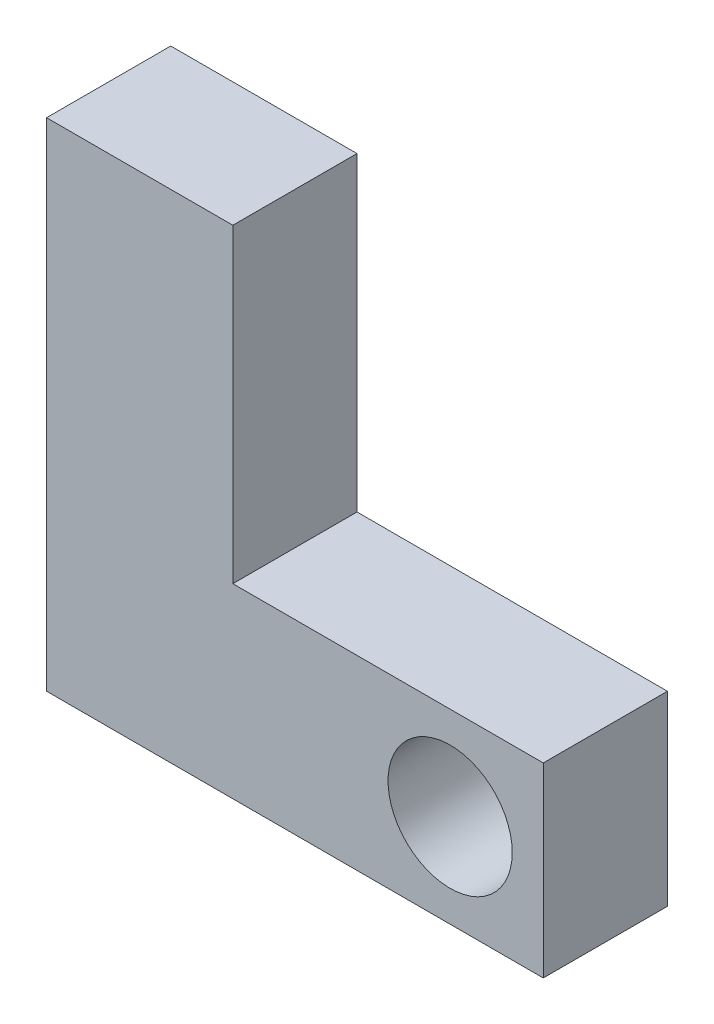
ISO-10303-21;
HEADER;
FILE_DESCRIPTION(('STEP AP214'),'2;1');
FILE_NAME('part.step','',(''),(''),'','','');
FILE_SCHEMA(('AUTOMOTIVE_DESIGN { 1 0 10303 214 1 1 1 1 }'));
ENDSEC;
DATA;
#1=APPLICATION_CONTEXT('core data for automotive mechanical design processes');
#2=APPLICATION_PROTOCOL_DEFINITION('international standard','automotive_design',2000,#1);
#3=PRODUCT_CONTEXT('',#1,'mechanical');
#4=PRODUCT('Part','Part','',(#3));
#5=PRODUCT_RELATED_PRODUCT_CATEGORY('part','',(#4));
#6=PRODUCT_DEFINITION_FORMATION('','',#4);
#7=PRODUCT_DEFINITION_CONTEXT('part definition',#1,'design');
#8=PRODUCT_DEFINITION('design','',#6,#7);
#9=PRODUCT_DEFINITION_SHAPE('','',#8);
#10=(LENGTH_UNIT() NAMED_UNIT(*) SI_UNIT(.MILLI.,.METRE.));
#11=(NAMED_UNIT(*) PLANE_ANGLE_UNIT() SI_UNIT($,.RADIAN.));
#12=(NAMED_UNIT(*) SI_UNIT($,.STERADIAN.) SOLID_ANGLE_UNIT());
#13=UNCERTAINTY_MEASURE_WITH_UNIT(LENGTH_MEASURE(1.E-05),#10,'distance_accuracy_value','');
#14=(GEOMETRIC_REPRESENTATION_CONTEXT(3) GLOBAL_UNCERTAINTY_ASSIGNED_CONTEXT((#13)) GLOBAL_UNIT_ASSIGNED_CONTEXT((#10,
#11,#12)) REPRESENTATION_CONTEXT('',''));
#15=CARTESIAN_POINT('',(0.,0.,0.));
#16=DIRECTION('',(0.,0.,1.));
#17=DIRECTION('',(1.,0.,0.));
#18=AXIS2_PLACEMENT_3D('',#15,#16,#17);
#19=CARTESIAN_POINT('',(-19.5011672723268,6.29081598942847,6.35));
#20=DIRECTION('',(1.,0.,0.));
#21=DIRECTION('',(0.,0.,-1.));
#22=AXIS2_PLACEMENT_3D('',#19,#20,#21);
#23=PLANE('',#22);
#24=CARTESIAN_POINT('',(-19.5011672723268,-6.40918401057153,3.175));
#25=DIRECTION('',(-1.,0.,0.));
#26=DIRECTION('',(0.,0.,1.));
#27=AXIS2_PLACEMENT_3D('',#24,#25,#26);
#28=CIRCLE('',#27,1.60964675899013);
#29=CARTESIAN_POINT('',(-19.5011672723268,-6.40918401057153,4.78464675899013));
#30=VERTEX_POINT('',#29);
#31=EDGE_CURVE('E158',#30,#30,#28,.T.);
#32=ORIENTED_EDGE('',*,*,#31,.F.);
#33=EDGE_LOOP('',(#32));
#34=FACE_BOUND('',#33,.T.);
#35=DIRECTION('',(0.,-1.,0.));
#36=VECTOR('',#35,1.);
#37=CARTESIAN_POINT('',(-19.5011672723268,6.29081598942847,0.));
#38=LINE('',#37,#36);
#39=CARTESIAN_POINT('',(-19.5011672723268,6.29081598942847,0.));
#40=VERTEX_POINT('',#39);
#41=CARTESIAN_POINT('',(-19.5011672723268,-19.1091840105715,0.));
#42=VERTEX_POINT('',#41);
#43=EDGE_CURVE('E115',#40,#42,#38,.T.);
#44=ORIENTED_EDGE('',*,*,#43,.T.);
#45=DIRECTION('',(0.,0.,-1.));
#46=VECTOR('',#45,1.);
#47=CARTESIAN_POINT('',(-19.5011672723268,-19.1091840105715,6.35));
#48=LINE('',#47,#46);
#49=CARTESIAN_POINT('',(-19.5011672723268,-19.1091840105715,6.35));
#50=VERTEX_POINT('',#49);
#51=EDGE_CURVE('E11',#50,#42,#48,.T.);
#52=ORIENTED_EDGE('',*,*,#51,.F.);
#53=DIRECTION('',(0.,-1.,0.));
#54=VECTOR('',#53,1.);
#55=CARTESIAN_POINT('',(-19.5011672723268,6.29081598942847,6.35));
#56=LINE('',#55,#54);
#57=CARTESIAN_POINT('',(-19.5011672723268,6.29081598942847,6.35));
#58=VERTEX_POINT('',#57);
#59=EDGE_CURVE('E126',#58,#50,#56,.T.);
#60=ORIENTED_EDGE('',*,*,#59,.F.);
#61=DIRECTION('',(0.,0.,-1.));
#62=VECTOR('',#61,1.);
#63=CARTESIAN_POINT('',(-19.5011672723268,6.29081598942847,6.35));
#64=LINE('',#63,#62);
#65=EDGE_CURVE('E111',#58,#40,#64,.T.);
#66=ORIENTED_EDGE('',*,*,#65,.T.);
#67=EDGE_LOOP('',(#44,#52,#60,#66));
#68=FACE_BOUND('',#67,.T.);
#69=ADVANCED_FACE('F31',(#34,#68),#23,.F.);
#70=CARTESIAN_POINT('',(-19.5011672723268,-19.1091840105715,6.35));
#71=DIRECTION('',(0.,1.,0.));
#72=DIRECTION('',(0.,0.,1.));
#73=AXIS2_PLACEMENT_3D('',#70,#71,#72);
#74=PLANE('',#73);
#75=DIRECTION('',(1.,0.,0.));
#76=VECTOR('',#75,1.);
#77=CARTESIAN_POINT('',(-19.5011672723268,-19.1091840105715,0.));
#78=LINE('',#77,#76);
#79=CARTESIAN_POINT('',(5.89883272767317,-19.1091840105715,0.));
#80=VERTEX_POINT('',#79);
#81=EDGE_CURVE('E118',#42,#80,#78,.T.);
#82=ORIENTED_EDGE('',*,*,#81,.T.);
#83=DIRECTION('',(0.,0.,-1.));
#84=VECTOR('',#83,1.);
#85=CARTESIAN_POINT('',(5.89883272767317,-19.1091840105715,6.35));
#86=LINE('',#85,#84);
#87=CARTESIAN_POINT('',(5.89883272767317,-19.1091840105715,6.35));
#88=VERTEX_POINT('',#87);
#89=EDGE_CURVE('E39',#88,#80,#86,.T.);
#90=ORIENTED_EDGE('',*,*,#89,.F.);
#91=DIRECTION('',(1.,0.,0.));
#92=VECTOR('',#91,1.);
#93=CARTESIAN_POINT('',(-19.5011672723268,-19.1091840105715,6.35));
#94=LINE('',#93,#92);
#95=EDGE_CURVE('E84',#50,#88,#94,.T.);
#96=ORIENTED_EDGE('',*,*,#95,.F.);
#97=ORIENTED_EDGE('',*,*,#51,.T.);
#98=EDGE_LOOP('',(#82,#90,#96,#97));
#99=FACE_BOUND('',#98,.T.);
#100=ADVANCED_FACE('F151',(#99),#74,.F.);
#101=CARTESIAN_POINT('',(5.89883272767317,-9.58418401057153,6.35));
#102=DIRECTION('',(-1.,0.,0.));
#103=DIRECTION('',(0.,-1.,0.));
#104=AXIS2_PLACEMENT_3D('',#101,#102,#103);
#105=PLANE('',#104);
#106=DIRECTION('',(0.,1.,0.));
#107=VECTOR('',#106,1.);
#108=CARTESIAN_POINT('',(5.89883272767317,-9.58418401057153,0.));
#109=LINE('',#108,#107);
#110=CARTESIAN_POINT('',(5.89883272767317,-9.58418401057153,0.));
#111=VERTEX_POINT('',#110);
#112=EDGE_CURVE('E121',#80,#111,#109,.T.);
#113=ORIENTED_EDGE('',*,*,#112,.T.);
#114=DIRECTION('',(0.,0.,-1.));
#115=VECTOR('',#114,1.);
#116=CARTESIAN_POINT('',(5.89883272767317,-9.58418401057153,6.35));
#117=LINE('',#116,#115);
#118=CARTESIAN_POINT('',(5.89883272767317,-9.58418401057153,6.35));
#119=VERTEX_POINT('',#118);
#120=EDGE_CURVE('E106',#119,#111,#117,.T.);
#121=ORIENTED_EDGE('',*,*,#120,.F.);
#122=DIRECTION('',(0.,1.,0.));
#123=VECTOR('',#122,1.);
#124=CARTESIAN_POINT('',(5.89883272767317,-9.58418401057153,6.35));
#125=LINE('',#124,#123);
#126=EDGE_CURVE('E97',#88,#119,#125,.T.);
#127=ORIENTED_EDGE('',*,*,#126,.F.);
#128=ORIENTED_EDGE('',*,*,#89,.T.);
#129=EDGE_LOOP('',(#113,#121,#127,#128));
#130=FACE_BOUND('',#129,.T.);
#131=ADVANCED_FACE('F132',(#130),#105,.F.);
#132=CARTESIAN_POINT('',(5.89883272767317,-9.58418401057153,6.35));
#133=DIRECTION('',(0.,-1.,0.));
#134=DIRECTION('',(1.,0.,0.));
#135=AXIS2_PLACEMENT_3D('',#132,#133,#134);
#136=PLANE('',#135);
#137=DIRECTION('',(-1.,0.,0.));
#138=VECTOR('',#137,1.);
#139=CARTESIAN_POINT('',(5.89883272767317,-9.58418401057153,0.));
#140=LINE('',#139,#138);
#141=CARTESIAN_POINT('',(-9.97616727232683,-9.58418401057154,0.));
#142=VERTEX_POINT('',#141);
#143=EDGE_CURVE('E105',#111,#142,#140,.T.);
#144=ORIENTED_EDGE('',*,*,#143,.T.);
#145=DIRECTION('',(0.,0.,-1.));
#146=VECTOR('',#145,1.);
#147=CARTESIAN_POINT('',(-9.97616727232683,-9.58418401057154,6.35));
#148=LINE('',#147,#146);
#149=CARTESIAN_POINT('',(-9.97616727232683,-9.58418401057154,6.35));
#150=VERTEX_POINT('',#149);
#151=EDGE_CURVE('E102',#150,#142,#148,.T.);
#152=ORIENTED_EDGE('',*,*,#151,.F.);
#153=DIRECTION('',(-1.,0.,0.));
#154=VECTOR('',#153,1.);
#155=CARTESIAN_POINT('',(5.89883272767317,-9.58418401057153,6.35));
#156=LINE('',#155,#154);
#157=EDGE_CURVE('E91',#119,#150,#156,.T.);
#158=ORIENTED_EDGE('',*,*,#157,.F.);
#159=ORIENTED_EDGE('',*,*,#120,.T.);
#160=EDGE_LOOP('',(#144,#152,#158,#159));
#161=FACE_BOUND('',#160,.T.);
#162=ADVANCED_FACE('F103',(#161),#136,.F.);
#163=CARTESIAN_POINT('',(-9.97616727232683,6.29081598942847,6.35));
#164=DIRECTION('',(-1.,0.,0.));
#165=DIRECTION('',(0.,-1.,0.));
#166=AXIS2_PLACEMENT_3D('',#163,#164,#165);
#167=PLANE('',#166);
#168=DIRECTION('',(0.,1.,0.));
#169=VECTOR('',#168,1.);
#170=CARTESIAN_POINT('',(-9.97616727232683,6.29081598942847,0.));
#171=LINE('',#170,#169);
#172=CARTESIAN_POINT('',(-9.97616727232683,6.29081598942847,0.));
#173=VERTEX_POINT('',#172);
#174=EDGE_CURVE('E70',#142,#173,#171,.T.);
#175=ORIENTED_EDGE('',*,*,#174,.T.);
#176=DIRECTION('',(0.,0.,-1.));
#177=VECTOR('',#176,1.);
#178=CARTESIAN_POINT('',(-9.97616727232683,6.29081598942847,6.35));
#179=LINE('',#178,#177);
#180=CARTESIAN_POINT('',(-9.97616727232683,6.29081598942847,6.35));
#181=VERTEX_POINT('',#180);
#182=EDGE_CURVE('E107',#181,#173,#179,.T.);
#183=ORIENTED_EDGE('',*,*,#182,.F.);
#184=DIRECTION('',(0.,1.,0.));
#185=VECTOR('',#184,1.);
#186=CARTESIAN_POINT('',(-9.97616727232683,6.29081598942847,6.35));
#187=LINE('',#186,#185);
#188=EDGE_CURVE('E95',#150,#181,#187,.T.);
#189=ORIENTED_EDGE('',*,*,#188,.F.);
#190=ORIENTED_EDGE('',*,*,#151,.T.);
#191=EDGE_LOOP('',(#175,#183,#189,#190));
#192=FACE_BOUND('',#191,.T.);
#193=ADVANCED_FACE('F109',(#192),#167,.F.);
#194=CARTESIAN_POINT('',(-19.5011672723268,6.29081598942847,6.35));
#195=DIRECTION('',(0.,-1.,0.));
#196=DIRECTION('',(0.,0.,-1.));
#197=AXIS2_PLACEMENT_3D('',#194,#195,#196);
#198=PLANE('',#197);
#199=DIRECTION('',(-1.,0.,0.));
#200=VECTOR('',#199,1.);
#201=CARTESIAN_POINT('',(-19.5011672723268,6.29081598942847,0.));
#202=LINE('',#201,#200);
#203=EDGE_CURVE('E76',#173,#40,#202,.T.);
#204=ORIENTED_EDGE('',*,*,#203,.T.);
#205=ORIENTED_EDGE('',*,*,#65,.F.);
#206=DIRECTION('',(-1.,0.,0.));
#207=VECTOR('',#206,1.);
#208=CARTESIAN_POINT('',(-19.5011672723268,6.29081598942847,6.35));
#209=LINE('',#208,#207);
#210=EDGE_CURVE('E47',#181,#58,#209,.T.);
#211=ORIENTED_EDGE('',*,*,#210,.F.);
#212=ORIENTED_EDGE('',*,*,#182,.T.);
#213=EDGE_LOOP('',(#204,#205,#211,#212));
#214=FACE_BOUND('',#213,.T.);
#215=ADVANCED_FACE('F139',(#214),#198,.F.);
#216=CARTESIAN_POINT('',(-19.5011672723268,-19.1091840105715,6.35));
#217=DIRECTION('',(0.,0.,1.));
#218=DIRECTION('',(1.,0.,0.));
#219=AXIS2_PLACEMENT_3D('',#216,#217,#218);
#220=PLANE('',#219);
#221=CARTESIAN_POINT('',(1.13633272767317,-14.3466840105715,6.35));
#222=DIRECTION('',(0.,0.,1.));
#223=DIRECTION('',(1.,0.,0.));
#224=AXIS2_PLACEMENT_3D('',#221,#222,#223);
#225=CIRCLE('',#224,3.175);
#226=CARTESIAN_POINT('',(4.31133272767317,-14.3466840105715,6.35));
#227=VERTEX_POINT('',#226);
#228=EDGE_CURVE('E163',#227,#227,#225,.T.);
#229=ORIENTED_EDGE('',*,*,#228,.F.);
#230=EDGE_LOOP('',(#229));
#231=FACE_BOUND('',#230,.T.);
#232=ORIENTED_EDGE('',*,*,#59,.T.);
#233=ORIENTED_EDGE('',*,*,#95,.T.);
#234=ORIENTED_EDGE('',*,*,#126,.T.);
#235=ORIENTED_EDGE('',*,*,#157,.T.);
#236=ORIENTED_EDGE('',*,*,#188,.T.);
#237=ORIENTED_EDGE('',*,*,#210,.T.);
#238=EDGE_LOOP('',(#232,#233,#234,#235,#236,#237));
#239=FACE_BOUND('',#238,.T.);
#240=ADVANCED_FACE('F93',(#231,#239),#220,.T.);
#241=CARTESIAN_POINT('',(-19.5011672723268,-19.1091840105715,0.));
#242=DIRECTION('',(0.,0.,1.));
#243=DIRECTION('',(1.,0.,0.));
#244=AXIS2_PLACEMENT_3D('',#241,#242,#243);
#245=PLANE('',#244);
#246=CARTESIAN_POINT('',(1.13633272767317,-14.3466840105715,0.));
#247=DIRECTION('',(0.,0.,1.));
#248=DIRECTION('',(1.,0.,0.));
#249=AXIS2_PLACEMENT_3D('',#246,#247,#248);
#250=CIRCLE('',#249,3.175);
#251=CARTESIAN_POINT('',(4.31133272767317,-14.3466840105715,0.));
#252=VERTEX_POINT('',#251);
#253=EDGE_CURVE('E119',#252,#252,#250,.T.);
#254=ORIENTED_EDGE('',*,*,#253,.T.);
#255=EDGE_LOOP('',(#254));
#256=FACE_BOUND('',#255,.T.);
#257=ORIENTED_EDGE('',*,*,#43,.F.);
#258=ORIENTED_EDGE('',*,*,#203,.F.);
#259=ORIENTED_EDGE('',*,*,#174,.F.);
#260=ORIENTED_EDGE('',*,*,#143,.F.);
#261=ORIENTED_EDGE('',*,*,#112,.F.);
#262=ORIENTED_EDGE('',*,*,#81,.F.);
#263=EDGE_LOOP('',(#257,#258,#259,#260,#261,#262));
#264=FACE_BOUND('',#263,.T.);
#265=ADVANCED_FACE('F135',(#256,#264),#245,.F.);
#266=CARTESIAN_POINT('',(1.13633272767317,-14.3466840105715,0.));
#267=DIRECTION('',(0.,0.,1.));
#268=DIRECTION('',(1.,0.,0.));
#269=AXIS2_PLACEMENT_3D('',#266,#267,#268);
#270=CYLINDRICAL_SURFACE('',#269,3.175);
#271=ORIENTED_EDGE('',*,*,#253,.F.);
#272=EDGE_LOOP('',(#271));
#273=FACE_BOUND('',#272,.T.);
#274=ORIENTED_EDGE('',*,*,#228,.T.);
#275=EDGE_LOOP('',(#274));
#276=FACE_BOUND('',#275,.T.);
#277=ADVANCED_FACE('F173',(#273,#276),#270,.F.);
#278=CARTESIAN_POINT('',(-13.1511672723268,-6.40918401057153,3.175));
#279=DIRECTION('',(-1.,0.,0.));
#280=DIRECTION('',(0.,0.,1.));
#281=AXIS2_PLACEMENT_3D('',#278,#279,#280);
#282=CYLINDRICAL_SURFACE('',#281,1.60964675899013);
#283=CARTESIAN_POINT('',(-13.1511672723268,-6.40918401057153,3.175));
#284=DIRECTION('',(-1.,0.,0.));
#285=DIRECTION('',(0.,0.,1.));
#286=AXIS2_PLACEMENT_3D('',#283,#284,#285);
#287=CIRCLE('',#286,1.60964675899013);
#288=CARTESIAN_POINT('',(-13.1511672723268,-6.40918401057153,4.78464675899013));
#289=VERTEX_POINT('',#288);
#290=EDGE_CURVE('E160',#289,#289,#287,.T.);
#291=ORIENTED_EDGE('',*,*,#290,.F.);
#292=EDGE_LOOP('',(#291));
#293=FACE_BOUND('',#292,.T.);
#294=ORIENTED_EDGE('',*,*,#31,.T.);
#295=EDGE_LOOP('',(#294));
#296=FACE_BOUND('',#295,.T.);
#297=ADVANCED_FACE('F175',(#293,#296),#282,.F.);
#298=CARTESIAN_POINT('',(-13.1511672723268,-6.40918401057153,3.175));
#299=DIRECTION('',(-1.,0.,0.));
#300=DIRECTION('',(0.,0.,1.));
#301=AXIS2_PLACEMENT_3D('',#298,#299,#300);
#302=PLANE('',#301);
#303=ORIENTED_EDGE('',*,*,#290,.T.);
#304=EDGE_LOOP('',(#303));
#305=FACE_BOUND('',#304,.T.);
#306=ADVANCED_FACE('F182',(#305),#302,.T.);
#307=CLOSED_SHELL('',(#69,#100,#131,#162,#193,#215,#240,#265,#277,#297,#306));
#308=MANIFOLD_SOLID_BREP('B2',#307);
#309=ADVANCED_BREP_SHAPE_REPRESENTATION('',(#18,#308),#14);
#310=SHAPE_DEFINITION_REPRESENTATION(#9,#309);
ENDSEC;
END-ISO-10303-21;
